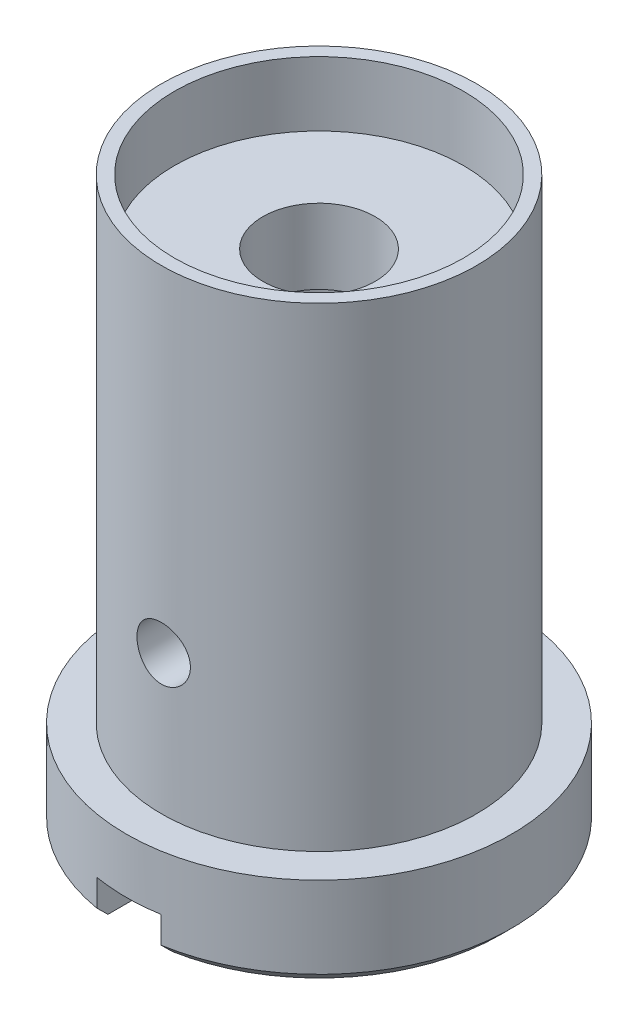
ISO-10303-21;
HEADER;
FILE_DESCRIPTION(('STEP AP214'),'2;1');
FILE_NAME('part.step','',(''),(''),'','','');
FILE_SCHEMA(('AUTOMOTIVE_DESIGN { 1 0 10303 214 1 1 1 1 }'));
ENDSEC;
DATA;
#1=APPLICATION_CONTEXT('core data for automotive mechanical design processes');
#2=APPLICATION_PROTOCOL_DEFINITION('international standard','automotive_design',2000,#1);
#3=PRODUCT_CONTEXT('',#1,'mechanical');
#4=PRODUCT('Part','Part','',(#3));
#5=PRODUCT_RELATED_PRODUCT_CATEGORY('part','',(#4));
#6=PRODUCT_DEFINITION_FORMATION('','',#4);
#7=PRODUCT_DEFINITION_CONTEXT('part definition',#1,'design');
#8=PRODUCT_DEFINITION('design','',#6,#7);
#9=PRODUCT_DEFINITION_SHAPE('','',#8);
#10=(LENGTH_UNIT() NAMED_UNIT(*) SI_UNIT(.MILLI.,.METRE.));
#11=(NAMED_UNIT(*) PLANE_ANGLE_UNIT() SI_UNIT($,.RADIAN.));
#12=(NAMED_UNIT(*) SI_UNIT($,.STERADIAN.) SOLID_ANGLE_UNIT());
#13=UNCERTAINTY_MEASURE_WITH_UNIT(LENGTH_MEASURE(1.E-05),#10,'distance_accuracy_value','');
#14=(GEOMETRIC_REPRESENTATION_CONTEXT(3) GLOBAL_UNCERTAINTY_ASSIGNED_CONTEXT((#13)) GLOBAL_UNIT_ASSIGNED_CONTEXT((#10,
#11,#12)) REPRESENTATION_CONTEXT('',''));
#15=CARTESIAN_POINT('',(0.,0.,0.));
#16=DIRECTION('',(0.,0.,1.));
#17=DIRECTION('',(1.,0.,0.));
#18=AXIS2_PLACEMENT_3D('',#15,#16,#17);
#19=CARTESIAN_POINT('',(4.1656,31.75,0.));
#20=DIRECTION('',(0.,-1.,0.));
#21=DIRECTION('',(0.,0.,-1.));
#22=AXIS2_PLACEMENT_3D('',#19,#20,#21);
#23=PLANE('',#22);
#24=CARTESIAN_POINT('',(0.,31.75,0.));
#25=DIRECTION('',(0.,-1.,0.));
#26=DIRECTION('',(0.,0.,-1.));
#27=AXIS2_PLACEMENT_3D('',#24,#25,#26);
#28=CIRCLE('',#27,4.1656);
#29=CARTESIAN_POINT('',(0.,31.75,-4.1656));
#30=VERTEX_POINT('',#29);
#31=EDGE_CURVE('E20',#30,#30,#28,.F.);
#32=ORIENTED_EDGE('',*,*,#31,.T.);
#33=EDGE_LOOP('',(#32));
#34=FACE_BOUND('',#33,.T.);
#35=CARTESIAN_POINT('',(0.,31.75,0.));
#36=DIRECTION('',(0.,-1.,0.));
#37=DIRECTION('',(0.,0.,-1.));
#38=AXIS2_PLACEMENT_3D('',#35,#36,#37);
#39=CIRCLE('',#38,4.5593);
#40=CARTESIAN_POINT('',(0.,31.75,-4.5593));
#41=VERTEX_POINT('',#40);
#42=EDGE_CURVE('E262',#41,#41,#39,.T.);
#43=ORIENTED_EDGE('',*,*,#42,.T.);
#44=EDGE_LOOP('',(#43));
#45=FACE_BOUND('',#44,.T.);
#46=ADVANCED_FACE('F17',(#34,#45),#23,.T.);
#47=CARTESIAN_POINT('',(0.,0.,0.));
#48=DIRECTION('',(0.,-1.,0.));
#49=DIRECTION('',(0.,0.,-1.));
#50=AXIS2_PLACEMENT_3D('',#47,#48,#49);
#51=CYLINDRICAL_SURFACE('',#50,4.1656);
#52=ORIENTED_EDGE('',*,*,#31,.F.);
#53=EDGE_LOOP('',(#52));
#54=FACE_BOUND('',#53,.T.);
#55=CARTESIAN_POINT('',(0.,37.2872,0.));
#56=DIRECTION('',(0.,-1.,0.));
#57=DIRECTION('',(0.,0.,-1.));
#58=AXIS2_PLACEMENT_3D('',#55,#56,#57);
#59=CIRCLE('',#58,4.1656);
#60=CARTESIAN_POINT('',(0.,37.2872,-4.1656));
#61=VERTEX_POINT('',#60);
#62=EDGE_CURVE('E260',#61,#61,#59,.T.);
#63=ORIENTED_EDGE('',*,*,#62,.F.);
#64=EDGE_LOOP('',(#63));
#65=FACE_BOUND('',#64,.T.);
#66=ADVANCED_FACE('F270',(#54,#65),#51,.F.);
#67=CARTESIAN_POINT('',(0.,0.,0.));
#68=DIRECTION('',(0.,-1.,0.));
#69=DIRECTION('',(0.,0.,-1.));
#70=AXIS2_PLACEMENT_3D('',#67,#68,#69);
#71=CYLINDRICAL_SURFACE('',#70,4.5593);
#72=CARTESIAN_POINT('',(0.,22.225,0.));
#73=DIRECTION('',(0.,-1.,0.));
#74=DIRECTION('',(0.,0.,-1.));
#75=AXIS2_PLACEMENT_3D('',#72,#73,#74);
#76=CIRCLE('',#75,4.5593);
#77=CARTESIAN_POINT('',(0.,22.225,-4.5593));
#78=VERTEX_POINT('',#77);
#79=EDGE_CURVE('E135',#78,#78,#76,.F.);
#80=ORIENTED_EDGE('',*,*,#79,.F.);
#81=EDGE_LOOP('',(#80));
#82=FACE_BOUND('',#81,.T.);
#83=ORIENTED_EDGE('',*,*,#42,.F.);
#84=EDGE_LOOP('',(#83));
#85=FACE_BOUND('',#84,.T.);
#86=ADVANCED_FACE('F273',(#82,#85),#71,.F.);
#87=CARTESIAN_POINT('',(10.7188,37.2872,0.));
#88=DIRECTION('',(0.,1.,0.));
#89=DIRECTION('',(0.,0.,1.));
#90=AXIS2_PLACEMENT_3D('',#87,#88,#89);
#91=PLANE('',#90);
#92=CARTESIAN_POINT('',(0.,37.2872,0.));
#93=DIRECTION('',(0.,-1.,0.));
#94=DIRECTION('',(0.,0.,-1.));
#95=AXIS2_PLACEMENT_3D('',#92,#93,#94);
#96=CIRCLE('',#95,10.7188);
#97=CARTESIAN_POINT('',(0.,37.2872,-10.7188));
#98=VERTEX_POINT('',#97);
#99=EDGE_CURVE('E146',#98,#98,#96,.F.);
#100=ORIENTED_EDGE('',*,*,#99,.T.);
#101=EDGE_LOOP('',(#100));
#102=FACE_BOUND('',#101,.T.);
#103=ORIENTED_EDGE('',*,*,#62,.T.);
#104=EDGE_LOOP('',(#103));
#105=FACE_BOUND('',#104,.T.);
#106=ADVANCED_FACE('F276',(#102,#105),#91,.T.);
#107=CARTESIAN_POINT('',(7.5946,0.,0.));
#108=DIRECTION('',(0.,-1.,0.));
#109=DIRECTION('',(0.,0.,-1.));
#110=AXIS2_PLACEMENT_3D('',#107,#108,#109);
#111=PLANE('',#110);
#112=DIRECTION('',(0.,0.,1.));
#113=VECTOR('',#112,1.);
#114=CARTESIAN_POINT('',(-2.3876,0.,-14.2875));
#115=LINE('',#114,#113);
#116=CARTESIAN_POINT('',(-2.3876,0.,-13.2614820563163));
#117=VERTEX_POINT('',#116);
#118=CARTESIAN_POINT('',(-2.3876,0.,-7.20952948534091));
#119=VERTEX_POINT('',#118);
#120=EDGE_CURVE('E147',#117,#119,#115,.T.);
#121=ORIENTED_EDGE('',*,*,#120,.T.);
#122=CARTESIAN_POINT('',(0.,0.,0.));
#123=DIRECTION('',(0.,-1.,0.));
#124=DIRECTION('',(0.,0.,-1.));
#125=AXIS2_PLACEMENT_3D('',#122,#123,#124);
#126=CIRCLE('',#125,7.5946);
#127=CARTESIAN_POINT('',(-2.3876,0.,7.20952948534091));
#128=VERTEX_POINT('',#127);
#129=EDGE_CURVE('E138',#119,#128,#126,.F.);
#130=ORIENTED_EDGE('',*,*,#129,.T.);
#131=DIRECTION('',(0.,0.,1.));
#132=VECTOR('',#131,1.);
#133=CARTESIAN_POINT('',(-2.3876,0.,-14.2875));
#134=LINE('',#133,#132);
#135=CARTESIAN_POINT('',(-2.3876,0.,13.2614820563163));
#136=VERTEX_POINT('',#135);
#137=EDGE_CURVE('E139',#128,#136,#134,.T.);
#138=ORIENTED_EDGE('',*,*,#137,.T.);
#139=CARTESIAN_POINT('',(0.,0.,0.));
#140=DIRECTION('',(0.,1.,0.));
#141=DIRECTION('',(-1.,0.,0.));
#142=AXIS2_PLACEMENT_3D('',#139,#140,#141);
#143=CIRCLE('',#142,13.4747);
#144=EDGE_CURVE('E142',#117,#136,#143,.T.);
#145=ORIENTED_EDGE('',*,*,#144,.F.);
#146=EDGE_LOOP('',(#121,#130,#138,#145));
#147=FACE_BOUND('',#146,.T.);
#148=ADVANCED_FACE('F278',(#147),#111,.T.);
#149=CARTESIAN_POINT('',(7.5946,0.,0.));
#150=DIRECTION('',(0.,-1.,0.));
#151=DIRECTION('',(0.,0.,-1.));
#152=AXIS2_PLACEMENT_3D('',#149,#150,#151);
#153=PLANE('',#152);
#154=DIRECTION('',(0.,0.,-1.));
#155=VECTOR('',#154,1.);
#156=CARTESIAN_POINT('',(2.3876,0.,-14.2875));
#157=LINE('',#156,#155);
#158=CARTESIAN_POINT('',(2.3876,0.,13.2614820563163));
#159=VERTEX_POINT('',#158);
#160=CARTESIAN_POINT('',(2.3876,0.,7.20952948534091));
#161=VERTEX_POINT('',#160);
#162=EDGE_CURVE('E99',#159,#161,#157,.T.);
#163=ORIENTED_EDGE('',*,*,#162,.T.);
#164=CARTESIAN_POINT('',(0.,0.,0.));
#165=DIRECTION('',(0.,-1.,0.));
#166=DIRECTION('',(0.,0.,-1.));
#167=AXIS2_PLACEMENT_3D('',#164,#165,#166);
#168=CIRCLE('',#167,7.5946);
#169=CARTESIAN_POINT('',(2.3876,0.,-7.20952948534091));
#170=VERTEX_POINT('',#169);
#171=EDGE_CURVE('E128',#161,#170,#168,.F.);
#172=ORIENTED_EDGE('',*,*,#171,.T.);
#173=DIRECTION('',(0.,0.,-1.));
#174=VECTOR('',#173,1.);
#175=CARTESIAN_POINT('',(2.3876,0.,-14.2875));
#176=LINE('',#175,#174);
#177=CARTESIAN_POINT('',(2.3876,0.,-13.2614820563163));
#178=VERTEX_POINT('',#177);
#179=EDGE_CURVE('E129',#170,#178,#176,.T.);
#180=ORIENTED_EDGE('',*,*,#179,.T.);
#181=CARTESIAN_POINT('',(0.,0.,0.));
#182=DIRECTION('',(0.,1.,0.));
#183=DIRECTION('',(-1.,0.,0.));
#184=AXIS2_PLACEMENT_3D('',#181,#182,#183);
#185=CIRCLE('',#184,13.4747);
#186=EDGE_CURVE('E103',#159,#178,#185,.T.);
#187=ORIENTED_EDGE('',*,*,#186,.F.);
#188=EDGE_LOOP('',(#163,#172,#180,#187));
#189=FACE_BOUND('',#188,.T.);
#190=ADVANCED_FACE('F285',(#189),#153,.T.);
#191=CARTESIAN_POINT('',(4.5593,22.225,0.));
#192=DIRECTION('',(0.,-1.,0.));
#193=DIRECTION('',(0.,0.,-1.));
#194=AXIS2_PLACEMENT_3D('',#191,#192,#193);
#195=PLANE('',#194);
#196=ORIENTED_EDGE('',*,*,#79,.T.);
#197=EDGE_LOOP('',(#196));
#198=FACE_BOUND('',#197,.T.);
#199=CARTESIAN_POINT('',(0.,22.225,0.));
#200=DIRECTION('',(0.,-1.,0.));
#201=DIRECTION('',(0.,0.,-1.));
#202=AXIS2_PLACEMENT_3D('',#199,#200,#201);
#203=CIRCLE('',#202,7.5946);
#204=CARTESIAN_POINT('',(0.,22.225,-7.5946));
#205=VERTEX_POINT('',#204);
#206=EDGE_CURVE('E119',#205,#205,#203,.T.);
#207=ORIENTED_EDGE('',*,*,#206,.T.);
#208=EDGE_LOOP('',(#207));
#209=FACE_BOUND('',#208,.T.);
#210=ADVANCED_FACE('F293',(#198,#209),#195,.T.);
#211=CARTESIAN_POINT('',(2.3876,0.,-14.2875));
#212=DIRECTION('',(1.,0.,0.));
#213=DIRECTION('',(0.,0.,-1.));
#214=AXIS2_PLACEMENT_3D('',#211,#212,#213);
#215=PLANE('',#214);
#216=ORIENTED_EDGE('',*,*,#162,.F.);
#217=CARTESIAN_POINT('',(2.3876,0.812799999999997,14.086590165473));
#218=CARTESIAN_POINT('',(2.3876,0.677271911538373,13.949132653244));
#219=CARTESIAN_POINT('',(2.3876,0.541774534073085,13.8116448881336));
#220=CARTESIAN_POINT('',(2.3876,0.270841200739572,13.5366088517482));
#221=CARTESIAN_POINT('',(2.3876,0.135405244871527,13.3990605804731));
#222=CARTESIAN_POINT('',(2.3876,0.,13.2614820563163));
#223=B_SPLINE_CURVE_WITH_KNOTS('',3,(#217,#218,#219,#220,#221,#222),.UNSPECIFIED.,.F.,.F.,(4,2,
4),(0.,0.579104328852117,1.15820865939542),.UNSPECIFIED.);
#224=CARTESIAN_POINT('',(2.3876,0.812799999999997,14.086590165473));
#225=VERTEX_POINT('',#224);
#226=EDGE_CURVE('E93',#225,#159,#223,.T.);
#227=ORIENTED_EDGE('',*,*,#226,.F.);
#228=DIRECTION('',(0.,-1.,0.));
#229=VECTOR('',#228,1.);
#230=CARTESIAN_POINT('',(2.3876,0.,14.086590165473));
#231=LINE('',#230,#229);
#232=CARTESIAN_POINT('',(2.3876,2.794,14.086590165473));
#233=VERTEX_POINT('',#232);
#234=EDGE_CURVE('E97',#233,#225,#231,.T.);
#235=ORIENTED_EDGE('',*,*,#234,.F.);
#236=DIRECTION('',(0.,0.,1.));
#237=VECTOR('',#236,1.);
#238=CARTESIAN_POINT('',(2.3876,2.794,-14.2875));
#239=LINE('',#238,#237);
#240=CARTESIAN_POINT('',(2.3876,2.794,7.20952948534091));
#241=VERTEX_POINT('',#240);
#242=EDGE_CURVE('E471',#233,#241,#239,.F.);
#243=ORIENTED_EDGE('',*,*,#242,.T.);
#244=DIRECTION('',(0.,-1.,0.));
#245=VECTOR('',#244,1.);
#246=CARTESIAN_POINT('',(2.3876,0.,7.20952948534091));
#247=LINE('',#246,#245);
#248=EDGE_CURVE('E131',#241,#161,#247,.T.);
#249=ORIENTED_EDGE('',*,*,#248,.T.);
#250=EDGE_LOOP('',(#216,#227,#235,#243,#249));
#251=FACE_BOUND('',#250,.T.);
#252=ADVANCED_FACE('F95',(#251),#215,.F.);
#253=CARTESIAN_POINT('',(0.,0.812799999999996,0.));
#254=DIRECTION('',(0.,1.,0.));
#255=DIRECTION('',(-1.,0.,0.));
#256=AXIS2_PLACEMENT_3D('',#253,#254,#255);
#257=CONICAL_SURFACE('',#256,14.2875,0.785398163397448);
#258=ORIENTED_EDGE('',*,*,#226,.T.);
#259=ORIENTED_EDGE('',*,*,#186,.T.);
#260=CARTESIAN_POINT('',(2.3876,0.,-13.2614820563163));
#261=CARTESIAN_POINT('',(2.3876,0.135405244871526,-13.3990605804731));
#262=CARTESIAN_POINT('',(2.3876,0.270841200739571,-13.5366088517482));
#263=CARTESIAN_POINT('',(2.3876,0.541774534073084,-13.8116448881336));
#264=CARTESIAN_POINT('',(2.3876,0.677271911538372,-13.949132653244));
#265=CARTESIAN_POINT('',(2.3876,0.812799999999997,-14.086590165473));
#266=B_SPLINE_CURVE_WITH_KNOTS('',3,(#260,#261,#262,#263,#264,#265),.UNSPECIFIED.,.F.,.F.,(4,2,
4),(0.,0.579104330543301,1.15820865939542),.UNSPECIFIED.);
#267=CARTESIAN_POINT('',(2.3876,0.812799999999997,-14.086590165473));
#268=VERTEX_POINT('',#267);
#269=EDGE_CURVE('E109',#178,#268,#266,.T.);
#270=ORIENTED_EDGE('',*,*,#269,.T.);
#271=CARTESIAN_POINT('',(0.,0.812799999999997,0.));
#272=DIRECTION('',(0.,-1.,0.));
#273=DIRECTION('',(0.,0.,-1.));
#274=AXIS2_PLACEMENT_3D('',#271,#272,#273);
#275=CIRCLE('',#274,14.2875);
#276=EDGE_CURVE('E106',#225,#268,#275,.F.);
#277=ORIENTED_EDGE('',*,*,#276,.F.);
#278=EDGE_LOOP('',(#258,#259,#270,#277));
#279=FACE_BOUND('',#278,.T.);
#280=ADVANCED_FACE('F107',(#279),#257,.T.);
#281=CARTESIAN_POINT('',(2.3876,0.,-14.2875));
#282=DIRECTION('',(1.,0.,0.));
#283=DIRECTION('',(0.,0.,-1.));
#284=AXIS2_PLACEMENT_3D('',#281,#282,#283);
#285=PLANE('',#284);
#286=DIRECTION('',(0.,0.,1.));
#287=VECTOR('',#286,1.);
#288=CARTESIAN_POINT('',(2.3876,2.794,-14.2875));
#289=LINE('',#288,#287);
#290=CARTESIAN_POINT('',(2.3876,2.794,-7.20952948534091));
#291=VERTEX_POINT('',#290);
#292=CARTESIAN_POINT('',(2.3876,2.794,-14.086590165473));
#293=VERTEX_POINT('',#292);
#294=EDGE_CURVE('E480',#291,#293,#289,.F.);
#295=ORIENTED_EDGE('',*,*,#294,.T.);
#296=DIRECTION('',(0.,-1.,0.));
#297=VECTOR('',#296,1.);
#298=CARTESIAN_POINT('',(2.3876,0.,-14.086590165473));
#299=LINE('',#298,#297);
#300=EDGE_CURVE('E113',#268,#293,#299,.F.);
#301=ORIENTED_EDGE('',*,*,#300,.F.);
#302=ORIENTED_EDGE('',*,*,#269,.F.);
#303=ORIENTED_EDGE('',*,*,#179,.F.);
#304=DIRECTION('',(0.,-1.,0.));
#305=VECTOR('',#304,1.);
#306=CARTESIAN_POINT('',(2.3876,0.,-7.20952948534091));
#307=LINE('',#306,#305);
#308=EDGE_CURVE('E126',#170,#291,#307,.F.);
#309=ORIENTED_EDGE('',*,*,#308,.T.);
#310=EDGE_LOOP('',(#295,#301,#302,#303,#309));
#311=FACE_BOUND('',#310,.T.);
#312=ADVANCED_FACE('F243',(#311),#285,.F.);
#313=CARTESIAN_POINT('',(-2.3876,2.794,-14.2875));
#314=DIRECTION('',(0.,1.,0.));
#315=DIRECTION('',(0.,0.,1.));
#316=AXIS2_PLACEMENT_3D('',#313,#314,#315);
#317=PLANE('',#316);
#318=CARTESIAN_POINT('',(0.,2.794,0.));
#319=DIRECTION('',(0.,-1.,0.));
#320=DIRECTION('',(0.,0.,-1.));
#321=AXIS2_PLACEMENT_3D('',#318,#319,#320);
#322=CIRCLE('',#321,7.5946);
#323=CARTESIAN_POINT('',(-2.3876,2.794,-7.20952948534091));
#324=VERTEX_POINT('',#323);
#325=EDGE_CURVE('E122',#291,#324,#322,.F.);
#326=ORIENTED_EDGE('',*,*,#325,.T.);
#327=DIRECTION('',(0.,0.,1.));
#328=VECTOR('',#327,1.);
#329=CARTESIAN_POINT('',(-2.3876,2.794,-14.2875));
#330=LINE('',#329,#328);
#331=CARTESIAN_POINT('',(-2.3876,2.794,-14.086590165473));
#332=VERTEX_POINT('',#331);
#333=EDGE_CURVE('E149',#324,#332,#330,.F.);
#334=ORIENTED_EDGE('',*,*,#333,.T.);
#335=CARTESIAN_POINT('',(0.,2.794,0.));
#336=DIRECTION('',(0.,-1.,0.));
#337=DIRECTION('',(0.,0.,-1.));
#338=AXIS2_PLACEMENT_3D('',#335,#336,#337);
#339=CIRCLE('',#338,14.2875);
#340=EDGE_CURVE('E456',#293,#332,#339,.F.);
#341=ORIENTED_EDGE('',*,*,#340,.F.);
#342=ORIENTED_EDGE('',*,*,#294,.F.);
#343=EDGE_LOOP('',(#326,#334,#341,#342));
#344=FACE_BOUND('',#343,.T.);
#345=ADVANCED_FACE('F240',(#344),#317,.F.);
#346=CARTESIAN_POINT('',(-2.3876,0.,-14.2875));
#347=DIRECTION('',(-1.,0.,0.));
#348=DIRECTION('',(0.,0.,1.));
#349=AXIS2_PLACEMENT_3D('',#346,#347,#348);
#350=PLANE('',#349);
#351=ORIENTED_EDGE('',*,*,#120,.F.);
#352=CARTESIAN_POINT('',(-2.3876,0.812799999999998,-14.086590165473));
#353=CARTESIAN_POINT('',(-2.3876,0.677271911538373,-13.949132653244));
#354=CARTESIAN_POINT('',(-2.3876,0.541774534073084,-13.8116448881336));
#355=CARTESIAN_POINT('',(-2.3876,0.270841200739571,-13.5366088517482));
#356=CARTESIAN_POINT('',(-2.3876,0.135405244871526,-13.3990605804731));
#357=CARTESIAN_POINT('',(-2.3876,0.,-13.2614820563163));
#358=B_SPLINE_CURVE_WITH_KNOTS('',3,(#352,#353,#354,#355,#356,#357),.UNSPECIFIED.,.F.,.F.,(4,2,
4),(0.,0.57910432885212,1.15820865939542),.UNSPECIFIED.);
#359=CARTESIAN_POINT('',(-2.3876,0.812799999999998,-14.086590165473));
#360=VERTEX_POINT('',#359);
#361=EDGE_CURVE('E148',#360,#117,#358,.T.);
#362=ORIENTED_EDGE('',*,*,#361,.F.);
#363=DIRECTION('',(0.,-1.,0.));
#364=VECTOR('',#363,1.);
#365=CARTESIAN_POINT('',(-2.38760000000001,0.,-14.086590165473));
#366=LINE('',#365,#364);
#367=EDGE_CURVE('E458',#332,#360,#366,.T.);
#368=ORIENTED_EDGE('',*,*,#367,.F.);
#369=ORIENTED_EDGE('',*,*,#333,.F.);
#370=DIRECTION('',(0.,-1.,0.));
#371=VECTOR('',#370,1.);
#372=CARTESIAN_POINT('',(-2.3876,0.,-7.20952948534091));
#373=LINE('',#372,#371);
#374=EDGE_CURVE('E143',#324,#119,#373,.T.);
#375=ORIENTED_EDGE('',*,*,#374,.T.);
#376=EDGE_LOOP('',(#351,#362,#368,#369,#375));
#377=FACE_BOUND('',#376,.T.);
#378=ADVANCED_FACE('F236',(#377),#350,.F.);
#379=CARTESIAN_POINT('',(0.,0.812799999999996,0.));
#380=DIRECTION('',(0.,1.,0.));
#381=DIRECTION('',(-1.,0.,0.));
#382=AXIS2_PLACEMENT_3D('',#379,#380,#381);
#383=CONICAL_SURFACE('',#382,14.2875,0.785398163397448);
#384=ORIENTED_EDGE('',*,*,#361,.T.);
#385=ORIENTED_EDGE('',*,*,#144,.T.);
#386=CARTESIAN_POINT('',(-2.3876,0.,13.2614820563163));
#387=CARTESIAN_POINT('',(-2.3876,0.135405244871529,13.3990605804731));
#388=CARTESIAN_POINT('',(-2.3876,0.270841200739574,13.5366088517482));
#389=CARTESIAN_POINT('',(-2.3876,0.541774534073086,13.8116448881336));
#390=CARTESIAN_POINT('',(-2.3876,0.677271911538373,13.949132653244));
#391=CARTESIAN_POINT('',(-2.3876,0.812799999999997,14.086590165473));
#392=B_SPLINE_CURVE_WITH_KNOTS('',3,(#386,#387,#388,#389,#390,#391),.UNSPECIFIED.,.F.,.F.,(4,2,
4),(0.,0.579104330543299,1.15820865939541),.UNSPECIFIED.);
#393=CARTESIAN_POINT('',(-2.3876,0.812799999999997,14.086590165473));
#394=VERTEX_POINT('',#393);
#395=EDGE_CURVE('E141',#136,#394,#392,.T.);
#396=ORIENTED_EDGE('',*,*,#395,.T.);
#397=CARTESIAN_POINT('',(0.,0.812799999999997,0.));
#398=DIRECTION('',(0.,-1.,0.));
#399=DIRECTION('',(0.,0.,-1.));
#400=AXIS2_PLACEMENT_3D('',#397,#398,#399);
#401=CIRCLE('',#400,14.2875);
#402=EDGE_CURVE('E453',#360,#394,#401,.F.);
#403=ORIENTED_EDGE('',*,*,#402,.F.);
#404=EDGE_LOOP('',(#384,#385,#396,#403));
#405=FACE_BOUND('',#404,.T.);
#406=ADVANCED_FACE('F213',(#405),#383,.T.);
#407=CARTESIAN_POINT('',(-2.3876,0.,-14.2875));
#408=DIRECTION('',(-1.,0.,0.));
#409=DIRECTION('',(0.,0.,1.));
#410=AXIS2_PLACEMENT_3D('',#407,#408,#409);
#411=PLANE('',#410);
#412=DIRECTION('',(0.,0.,1.));
#413=VECTOR('',#412,1.);
#414=CARTESIAN_POINT('',(-2.3876,2.794,-14.2875));
#415=LINE('',#414,#413);
#416=CARTESIAN_POINT('',(-2.3876,2.794,7.20952948534091));
#417=VERTEX_POINT('',#416);
#418=CARTESIAN_POINT('',(-2.3876,2.794,14.086590165473));
#419=VERTEX_POINT('',#418);
#420=EDGE_CURVE('E35',#417,#419,#415,.T.);
#421=ORIENTED_EDGE('',*,*,#420,.T.);
#422=DIRECTION('',(0.,-1.,0.));
#423=VECTOR('',#422,1.);
#424=CARTESIAN_POINT('',(-2.3876,0.,14.086590165473));
#425=LINE('',#424,#423);
#426=EDGE_CURVE('E452',#394,#419,#425,.F.);
#427=ORIENTED_EDGE('',*,*,#426,.F.);
#428=ORIENTED_EDGE('',*,*,#395,.F.);
#429=ORIENTED_EDGE('',*,*,#137,.F.);
#430=DIRECTION('',(0.,-1.,0.));
#431=VECTOR('',#430,1.);
#432=CARTESIAN_POINT('',(-2.3876,0.,7.20952948534091));
#433=LINE('',#432,#431);
#434=EDGE_CURVE('E136',#128,#417,#433,.F.);
#435=ORIENTED_EDGE('',*,*,#434,.T.);
#436=EDGE_LOOP('',(#421,#427,#428,#429,#435));
#437=FACE_BOUND('',#436,.T.);
#438=ADVANCED_FACE('F208',(#437),#411,.F.);
#439=CARTESIAN_POINT('',(-2.3876,2.794,-14.2875));
#440=DIRECTION('',(0.,1.,0.));
#441=DIRECTION('',(0.,0.,1.));
#442=AXIS2_PLACEMENT_3D('',#439,#440,#441);
#443=PLANE('',#442);
#444=CARTESIAN_POINT('',(0.,2.794,0.));
#445=DIRECTION('',(0.,-1.,0.));
#446=DIRECTION('',(0.,0.,-1.));
#447=AXIS2_PLACEMENT_3D('',#444,#445,#446);
#448=CIRCLE('',#447,7.5946);
#449=EDGE_CURVE('E133',#417,#241,#448,.F.);
#450=ORIENTED_EDGE('',*,*,#449,.T.);
#451=ORIENTED_EDGE('',*,*,#242,.F.);
#452=CARTESIAN_POINT('',(0.,2.794,0.));
#453=DIRECTION('',(0.,-1.,0.));
#454=DIRECTION('',(0.,0.,-1.));
#455=AXIS2_PLACEMENT_3D('',#452,#453,#454);
#456=CIRCLE('',#455,14.2875);
#457=EDGE_CURVE('E117',#419,#233,#456,.F.);
#458=ORIENTED_EDGE('',*,*,#457,.F.);
#459=ORIENTED_EDGE('',*,*,#420,.F.);
#460=EDGE_LOOP('',(#450,#451,#458,#459));
#461=FACE_BOUND('',#460,.T.);
#462=ADVANCED_FACE('F204',(#461),#443,.F.);
#463=CARTESIAN_POINT('',(0.,0.,0.));
#464=DIRECTION('',(0.,-1.,0.));
#465=DIRECTION('',(0.,0.,-1.));
#466=AXIS2_PLACEMENT_3D('',#463,#464,#465);
#467=CYLINDRICAL_SURFACE('',#466,10.7188);
#468=ORIENTED_EDGE('',*,*,#99,.F.);
#469=EDGE_LOOP('',(#468));
#470=FACE_BOUND('',#469,.T.);
#471=CARTESIAN_POINT('',(0.,42.0624,0.));
#472=DIRECTION('',(0.,-1.,0.));
#473=DIRECTION('',(0.,0.,-1.));
#474=AXIS2_PLACEMENT_3D('',#471,#472,#473);
#475=CIRCLE('',#474,10.7188);
#476=CARTESIAN_POINT('',(0.,42.0624,-10.7188));
#477=VERTEX_POINT('',#476);
#478=EDGE_CURVE('E188',#477,#477,#475,.T.);
#479=ORIENTED_EDGE('',*,*,#478,.F.);
#480=EDGE_LOOP('',(#479));
#481=FACE_BOUND('',#480,.T.);
#482=ADVANCED_FACE('F200',(#470,#481),#467,.F.);
#483=CARTESIAN_POINT('',(0.,0.,0.));
#484=DIRECTION('',(0.,-1.,0.));
#485=DIRECTION('',(0.,0.,-1.));
#486=AXIS2_PLACEMENT_3D('',#483,#484,#485);
#487=CYLINDRICAL_SURFACE('',#486,7.5946);
#488=ORIENTED_EDGE('',*,*,#449,.F.);
#489=ORIENTED_EDGE('',*,*,#434,.F.);
#490=ORIENTED_EDGE('',*,*,#129,.F.);
#491=ORIENTED_EDGE('',*,*,#374,.F.);
#492=ORIENTED_EDGE('',*,*,#325,.F.);
#493=ORIENTED_EDGE('',*,*,#308,.F.);
#494=ORIENTED_EDGE('',*,*,#171,.F.);
#495=ORIENTED_EDGE('',*,*,#248,.F.);
#496=EDGE_LOOP('',(#488,#489,#490,#491,#492,#493,#494,#495));
#497=FACE_BOUND('',#496,.T.);
#498=ORIENTED_EDGE('',*,*,#206,.F.);
#499=EDGE_LOOP('',(#498));
#500=FACE_BOUND('',#499,.T.);
#501=CARTESIAN_POINT('',(-1.9812,17.1704,7.33162981334982));
#502=CARTESIAN_POINT('',(-1.98119521072431,17.061209217071,7.33163311535142));
#503=CARTESIAN_POINT('',(-1.97213889495164,16.9519566163936,7.33409691801363));
#504=CARTESIAN_POINT('',(-1.93620470272094,16.736567276342,7.34366336527781));
#505=CARTESIAN_POINT('',(-1.90930944226493,16.6304336818921,7.35077053472541));
#506=CARTESIAN_POINT('',(-1.83863719617433,16.4244776029982,7.36876385555579));
#507=CARTESIAN_POINT('',(-1.7948860301869,16.3246457365379,7.37964422466909));
#508=CARTESIAN_POINT('',(-1.691820548793,16.1337379992916,7.40395053014545));
#509=CARTESIAN_POINT('',(-1.63250704690063,16.0426616711538,7.4173763334369));
#510=CARTESIAN_POINT('',(-1.49848397159982,15.869658469436,7.44562112767283));
#511=CARTESIAN_POINT('',(-1.42346987489287,15.7879713512349,7.46046392480194));
#512=CARTESIAN_POINT('',(-1.26080950382795,15.6381660649204,7.48966787559681));
#513=CARTESIAN_POINT('',(-1.1731593628474,15.5700520654277,7.50402888017013));
#514=CARTESIAN_POINT('',(-0.986042436964098,15.4483294776873,7.5309186139053));
#515=CARTESIAN_POINT('',(-0.886411870296736,15.3949651665993,7.54341507041067));
#516=CARTESIAN_POINT('',(-0.679276300169876,15.3058850578184,7.5648746178666));
#517=CARTESIAN_POINT('',(-0.57178056933693,15.2701488505397,7.57384179252913));
#518=CARTESIAN_POINT('',(-0.386460957627434,15.2257038150976,7.58513989806004));
#519=CARTESIAN_POINT('',(-0.3098619818001,15.2120388289535,7.58866894698713));
#520=CARTESIAN_POINT('',(-0.155519056657319,15.1937854088474,7.59339998742644));
#521=CARTESIAN_POINT('',(-0.0777751506263136,15.1891966326394,7.59460206668408));
#522=CARTESIAN_POINT('',(0.109262013803818,15.1892047306189,7.59459709662967));
#523=CARTESIAN_POINT('',(0.218585691592104,15.1982724645154,7.59221770427256));
#524=CARTESIAN_POINT('',(0.434122885834854,15.2342561389339,7.58295175816065));
#525=CARTESIAN_POINT('',(0.540333313905021,15.2611892154565,7.57606087717865));
#526=CARTESIAN_POINT('',(0.746452206734361,15.3319719528333,7.55853458072446));
#527=CARTESIAN_POINT('',(0.846369409086309,15.3757975294257,7.54790449824765));
#528=CARTESIAN_POINT('',(1.03742177948824,15.4790385411441,7.52402727563521));
#529=CARTESIAN_POINT('',(1.12855750211491,15.5384529909028,7.51078030092551));
#530=CARTESIAN_POINT('',(1.30150086689282,15.6725810829011,7.482772190665));
#531=CARTESIAN_POINT('',(1.38308592256652,15.7475765153094,7.46798610328893));
#532=CARTESIAN_POINT('',(1.53269214779193,15.9101558363616,7.43872496569403));
#533=CARTESIAN_POINT('',(1.6007088356187,15.9977438680438,7.42425001965131));
#534=CARTESIAN_POINT('',(1.72232365581593,16.1847993583505,7.39699328659899));
#535=CARTESIAN_POINT('',(1.77566118795565,16.2844412269387,7.38424392197748));
#536=CARTESIAN_POINT('',(1.86468855061582,16.491600773076,7.36226923774329));
#537=CARTESIAN_POINT('',(1.90039913178158,16.5991090181401,7.35303977738518));
#538=CARTESIAN_POINT('',(1.94477644243474,16.7843618577931,7.34139820893294));
#539=CARTESIAN_POINT('',(1.95841114549109,16.8608757102683,7.33775607654893));
#540=CARTESIAN_POINT('',(1.9766244341169,17.0150493094683,7.33287075542865));
#541=CARTESIAN_POINT('',(1.98120340764645,17.0927090069599,7.33162746392274));
#542=CARTESIAN_POINT('',(1.98119521072431,17.279590782929,7.33163311535142));
#543=CARTESIAN_POINT('',(1.97213889495164,17.3888433836064,7.33409691801363));
#544=CARTESIAN_POINT('',(1.93620470272094,17.604232723658,7.34366336527781));
#545=CARTESIAN_POINT('',(1.90930944226493,17.7103663181079,7.35077053472541));
#546=CARTESIAN_POINT('',(1.83863719617433,17.9163223970018,7.36876385555579));
#547=CARTESIAN_POINT('',(1.7948860301869,18.0161542634621,7.37964422466909));
#548=CARTESIAN_POINT('',(1.691820548793,18.2070620007084,7.40395053014545));
#549=CARTESIAN_POINT('',(1.63250704690063,18.2981383288462,7.4173763334369));
#550=CARTESIAN_POINT('',(1.49848397159982,18.471141530564,7.44562112767283));
#551=CARTESIAN_POINT('',(1.42346987489287,18.5528286487651,7.46046392480194));
#552=CARTESIAN_POINT('',(1.26080950382795,18.7026339350796,7.48966787559681));
#553=CARTESIAN_POINT('',(1.1731593628474,18.7707479345723,7.50402888017013));
#554=CARTESIAN_POINT('',(0.986042436964099,18.8924705223127,7.53091861390531));
#555=CARTESIAN_POINT('',(0.886411870296735,18.9458348334007,7.54341507041067));
#556=CARTESIAN_POINT('',(0.679276300169876,19.0349149421816,7.56487461786659));
#557=CARTESIAN_POINT('',(0.57178056933693,19.0706511494603,7.57384179252913));
#558=CARTESIAN_POINT('',(0.386460957627435,19.1150961849024,7.58513989806004));
#559=CARTESIAN_POINT('',(0.309861981800101,19.1287611710465,7.58866894698713));
#560=CARTESIAN_POINT('',(0.155519056657319,19.1470145911526,7.59339998742644));
#561=CARTESIAN_POINT('',(0.0777751506263143,19.1516033673606,7.59460206668408));
#562=CARTESIAN_POINT('',(-0.109262013803817,19.1515952693811,7.59459709662967));
#563=CARTESIAN_POINT('',(-0.218585691592103,19.1425275354846,7.59221770427256));
#564=CARTESIAN_POINT('',(-0.434122885834853,19.1065438610661,7.58295175816065));
#565=CARTESIAN_POINT('',(-0.54033331390502,19.0796107845435,7.57606087717865));
#566=CARTESIAN_POINT('',(-0.74645220673436,19.0088280471667,7.55853458072446));
#567=CARTESIAN_POINT('',(-0.846369409086307,18.9650024705743,7.54790449824765));
#568=CARTESIAN_POINT('',(-1.03742177948824,18.8617614588559,7.52402727563521));
#569=CARTESIAN_POINT('',(-1.12855750211491,18.8023470090972,7.51078030092551));
#570=CARTESIAN_POINT('',(-1.30150086689281,18.6682189170989,7.482772190665));
#571=CARTESIAN_POINT('',(-1.38308592256652,18.5932234846906,7.46798610328893));
#572=CARTESIAN_POINT('',(-1.53269214779193,18.4306441636384,7.43872496569403));
#573=CARTESIAN_POINT('',(-1.6007088356187,18.3430561319562,7.42425001965131));
#574=CARTESIAN_POINT('',(-1.72232365581592,18.1560006416495,7.39699328659899));
#575=CARTESIAN_POINT('',(-1.77566118795565,18.0563587730613,7.38424392197748));
#576=CARTESIAN_POINT('',(-1.86468855061582,17.849199226924,7.36226923774329));
#577=CARTESIAN_POINT('',(-1.90039913178158,17.7416909818599,7.35303977738518));
#578=CARTESIAN_POINT('',(-1.94477644243474,17.5564381422069,7.34139820893294));
#579=CARTESIAN_POINT('',(-1.95841114549109,17.4799242897317,7.33775607654893));
#580=CARTESIAN_POINT('',(-1.9766244341169,17.3257506905317,7.33287075542865));
#581=CARTESIAN_POINT('',(-1.98120340764645,17.2480909930401,7.33162746392274));
#582=CARTESIAN_POINT('',(-1.9812,17.1704,7.33162981334982));
#583=B_SPLINE_CURVE_WITH_KNOTS('',3,(#501,#502,#503,#504,#505,#506,#507,#508,#509,#510,#511,
#512,#513,#514,#515,#516,#517,#518,#519,#520,#521,#522,#523,#524,#525,#526,#527,#528,#529,#530,
#531,#532,#533,#534,#535,#536,#537,#538,#539,#540,#541,#542,#543,#544,#545,#546,#547,#548,#549,
#550,#551,#552,#553,#554,#555,#556,#557,#558,#559,#560,#561,#562,#563,#564,#565,#566,#567,#568,
#569,#570,#571,#572,#573,#574,#575,#576,#577,#578,#579,#580,#581,#582),.UNSPECIFIED.,.T.,.F.,(4,
2,2,2,2,2,2,2,2,2,2,2,2,2,2,2,2,2,2,2,2,2,2,2,2,2,2,2,2,2,2,2,2,2,2,2,2,2,2,2,4),(0.,
0.327283294732184,0.654885995562378,0.981988861493613,1.30907463167553,1.6432163178033,
1.97746046898888,2.31694728850994,2.65604012670124,2.88916890993537,3.12228890217382,
3.44978630468333,3.77759828981848,4.1049446198074,4.43227026332947,4.76613158277652,
5.10010299697361,5.43966856226674,5.77883342808863,6.01171071761827,6.24457803014349,
6.57186132487567,6.89946402570586,7.22656689163709,7.55365266181901,7.88779434794678,
8.22203849913236,8.56152531865343,8.90061815684472,9.13374694007885,9.3668669323173,
9.69436433482681,10.022176319962,10.3495226499509,10.676848293473,11.01070961292,
11.3446810271171,11.6842465924102,12.0234114582321,12.2562887477617,12.489156060287),.UNSPECIFIED.);
#584=CARTESIAN_POINT('',(-1.9812,17.1704,7.33162981334982));
#585=VERTEX_POINT('',#584);
#586=EDGE_CURVE('E186',#585,#585,#583,.T.);
#587=ORIENTED_EDGE('',*,*,#586,.T.);
#588=EDGE_LOOP('',(#587));
#589=FACE_BOUND('',#588,.T.);
#590=ADVANCED_FACE('F195',(#497,#500,#589),#487,.F.);
#591=CARTESIAN_POINT('',(0.,0.,0.));
#592=DIRECTION('',(0.,-1.,0.));
#593=DIRECTION('',(0.,0.,-1.));
#594=AXIS2_PLACEMENT_3D('',#591,#592,#593);
#595=CYLINDRICAL_SURFACE('',#594,14.2875);
#596=CARTESIAN_POINT('',(0.,6.858,0.));
#597=DIRECTION('',(0.,-1.,0.));
#598=DIRECTION('',(0.,0.,-1.));
#599=AXIS2_PLACEMENT_3D('',#596,#597,#598);
#600=CIRCLE('',#599,14.2875);
#601=CARTESIAN_POINT('',(0.,6.858,-14.2875));
#602=VERTEX_POINT('',#601);
#603=EDGE_CURVE('E179',#602,#602,#600,.F.);
#604=ORIENTED_EDGE('',*,*,#603,.F.);
#605=EDGE_LOOP('',(#604));
#606=FACE_BOUND('',#605,.T.);
#607=ORIENTED_EDGE('',*,*,#426,.T.);
#608=ORIENTED_EDGE('',*,*,#457,.T.);
#609=ORIENTED_EDGE('',*,*,#234,.T.);
#610=ORIENTED_EDGE('',*,*,#276,.T.);
#611=ORIENTED_EDGE('',*,*,#300,.T.);
#612=ORIENTED_EDGE('',*,*,#340,.T.);
#613=ORIENTED_EDGE('',*,*,#367,.T.);
#614=ORIENTED_EDGE('',*,*,#402,.T.);
#615=EDGE_LOOP('',(#607,#608,#609,#610,#611,#612,#613,#614));
#616=FACE_BOUND('',#615,.T.);
#617=ADVANCED_FACE('F116',(#606,#616),#595,.T.);
#618=CARTESIAN_POINT('',(11.684,42.0624,0.));
#619=DIRECTION('',(0.,1.,0.));
#620=DIRECTION('',(0.,0.,1.));
#621=AXIS2_PLACEMENT_3D('',#618,#619,#620);
#622=PLANE('',#621);
#623=CARTESIAN_POINT('',(0.,42.0624,0.));
#624=DIRECTION('',(0.,-1.,0.));
#625=DIRECTION('',(0.,0.,-1.));
#626=AXIS2_PLACEMENT_3D('',#623,#624,#625);
#627=CIRCLE('',#626,11.684);
#628=CARTESIAN_POINT('',(0.,42.0624,-11.684));
#629=VERTEX_POINT('',#628);
#630=EDGE_CURVE('E157',#629,#629,#627,.T.);
#631=ORIENTED_EDGE('',*,*,#630,.F.);
#632=EDGE_LOOP('',(#631));
#633=FACE_BOUND('',#632,.T.);
#634=ORIENTED_EDGE('',*,*,#478,.T.);
#635=EDGE_LOOP('',(#634));
#636=FACE_BOUND('',#635,.T.);
#637=ADVANCED_FACE('F174',(#633,#636),#622,.T.);
#638=CARTESIAN_POINT('',(0.,17.1704,16.764));
#639=DIRECTION('',(0.,0.,-1.));
#640=DIRECTION('',(-1.,0.,0.));
#641=AXIS2_PLACEMENT_3D('',#638,#639,#640);
#642=CYLINDRICAL_SURFACE('',#641,1.9812);
#643=ORIENTED_EDGE('',*,*,#586,.F.);
#644=EDGE_LOOP('',(#643));
#645=FACE_BOUND('',#644,.T.);
#646=CARTESIAN_POINT('',(0.,19.1516,11.684));
#647=CARTESIAN_POINT('',(0.110423292230109,19.1515952203441,11.6839979331365));
#648=CARTESIAN_POINT('',(0.220915307998587,19.1423360792642,11.6824181384414));
#649=CARTESIAN_POINT('',(0.438808777050069,19.1055572049617,11.6762673596921));
#650=CARTESIAN_POINT('',(0.546206881652143,19.0780184084115,11.6716932530247));
#651=CARTESIAN_POINT('',(0.754714903941659,19.0055367643508,11.6600667858392));
#652=CARTESIAN_POINT('',(0.855830181706817,18.9606089952498,11.6530165729033));
#653=CARTESIAN_POINT('',(1.04906833803922,18.8546658411444,11.6372128296948));
#654=CARTESIAN_POINT('',(1.14119274520462,18.793653197389,11.6284595897253));
#655=CARTESIAN_POINT('',(1.31475737342468,18.656636101764,11.6101232801091));
#656=CARTESIAN_POINT('',(1.39609685768529,18.5805049199424,11.6005336087917));
#657=CARTESIAN_POINT('',(1.54493006893701,18.415662169024,11.5816531868232));
#658=CARTESIAN_POINT('',(1.61241989638987,18.3269470686316,11.5723625209799));
#659=CARTESIAN_POINT('',(1.73204888722455,18.138739501316,11.5550660624445));
#660=CARTESIAN_POINT('',(1.78408037083922,18.0391777478296,11.5470694516295));
#661=CARTESIAN_POINT('',(1.87058891366031,17.8326370232162,11.5333728400039));
#662=CARTESIAN_POINT('',(1.90508577069716,17.7256665728469,11.527670250606));
#663=CARTESIAN_POINT('',(1.94719886066994,17.5435040480097,11.5206141495783));
#664=CARTESIAN_POINT('',(1.95993018500935,17.4694854912555,11.5184462845095));
#665=CARTESIAN_POINT('',(1.97693232193825,17.3204552009519,11.5155402922547));
#666=CARTESIAN_POINT('',(1.98120325615402,17.2454434816958,11.5148021445151));
#667=CARTESIAN_POINT('',(1.98119520926565,17.0599895638966,11.5148058072612));
#668=CARTESIAN_POINT('',(1.97193815143587,16.9495103721811,11.5164090520487));
#669=CARTESIAN_POINT('',(1.93516830539018,16.7316435595865,11.5226435132313));
#670=CARTESIAN_POINT('',(1.90763640989389,16.6242592973606,11.5272778987651));
#671=CARTESIAN_POINT('',(1.8351749444561,16.415780562696,11.5390349227712));
#672=CARTESIAN_POINT('',(1.79026077679499,16.3146806135722,11.5461553578316));
#673=CARTESIAN_POINT('',(1.68434967272017,16.1214682416285,11.5620792400729));
#674=CARTESIAN_POINT('',(1.62335544500094,16.0293543086864,11.5708824037287));
#675=CARTESIAN_POINT('',(1.48635712830744,15.8557782753498,11.5892797690501));
#676=CARTESIAN_POINT('',(1.41022218136211,15.7744201310754,11.5988804092585));
#677=CARTESIAN_POINT('',(1.24536401232562,15.6255507803641,11.6177361823268));
#678=CARTESIAN_POINT('',(1.15663730856823,15.5580434163868,11.6269912187291));
#679=CARTESIAN_POINT('',(0.96841918932085,15.438395773837,11.6441832074982));
#680=CARTESIAN_POINT('',(0.868860485887748,15.3863600379428,11.6521110414778));
#681=CARTESIAN_POINT('',(0.662326345677575,15.2998427619851,11.6656695345154));
#682=CARTESIAN_POINT('',(0.555359401688339,15.2653414869167,11.6713027747103));
#683=CARTESIAN_POINT('',(0.37318513980482,15.2232159999873,11.6782689545537));
#684=CARTESIAN_POINT('',(0.299150313373458,15.2104790743609,11.6804076004228));
#685=CARTESIAN_POINT('',(0.150087566882124,15.1934695076974,11.6832738159795));
#686=CARTESIAN_POINT('',(0.0750596604000862,15.1891967510537,11.6840014049398));
#687=CARTESIAN_POINT('',(-0.110423292230106,15.1892047796559,11.6839979331365));
#688=CARTESIAN_POINT('',(-0.220915307998584,15.1984639207358,11.6824181384414));
#689=CARTESIAN_POINT('',(-0.438808777050066,15.2352427950383,11.6762673596921));
#690=CARTESIAN_POINT('',(-0.546206881652139,15.2627815915885,11.6716932530247));
#691=CARTESIAN_POINT('',(-0.754714903941656,15.3352632356492,11.6600667858392));
#692=CARTESIAN_POINT('',(-0.855830181706814,15.3801910047502,11.6530165729033));
#693=CARTESIAN_POINT('',(-1.04906833803921,15.4861341588556,11.6372128296948));
#694=CARTESIAN_POINT('',(-1.14119274520461,15.547146802611,11.6284595897253));
#695=CARTESIAN_POINT('',(-1.31475737342468,15.684163898236,11.6101232801091));
#696=CARTESIAN_POINT('',(-1.39609685768529,15.7602950800576,11.6005336087917));
#697=CARTESIAN_POINT('',(-1.54493006893701,15.925137830976,11.5816531868232));
#698=CARTESIAN_POINT('',(-1.61241989638987,16.0138529313684,11.5723625209799));
#699=CARTESIAN_POINT('',(-1.73204888722455,16.2020604986839,11.5550660624445));
#700=CARTESIAN_POINT('',(-1.78408037083922,16.3016222521704,11.5470694516295));
#701=CARTESIAN_POINT('',(-1.87058891366031,16.5081629767838,11.5333728400039));
#702=CARTESIAN_POINT('',(-1.90508577069716,16.6151334271531,11.527670250606));
#703=CARTESIAN_POINT('',(-1.94719886066994,16.7972959519903,11.5206141495783));
#704=CARTESIAN_POINT('',(-1.95993018500935,16.8713145087445,11.5184462845095));
#705=CARTESIAN_POINT('',(-1.97693232193825,17.0203447990481,11.5155402922547));
#706=CARTESIAN_POINT('',(-1.98120325615402,17.0953565183042,11.5148021445151));
#707=CARTESIAN_POINT('',(-1.98119520926565,17.2808104361034,11.5148058072612));
#708=CARTESIAN_POINT('',(-1.97193815143587,17.3912896278189,11.5164090520487));
#709=CARTESIAN_POINT('',(-1.93516830539018,17.6091564404135,11.5226435132313));
#710=CARTESIAN_POINT('',(-1.90763640989389,17.7165407026394,11.5272778987651));
#711=CARTESIAN_POINT('',(-1.8351749444561,17.925019437304,11.5390349227712));
#712=CARTESIAN_POINT('',(-1.79026077679499,18.0261193864278,11.5461553578316));
#713=CARTESIAN_POINT('',(-1.68434967272017,18.2193317583715,11.5620792400729));
#714=CARTESIAN_POINT('',(-1.62335544500094,18.3114456913136,11.5708824037287));
#715=CARTESIAN_POINT('',(-1.48635712830744,18.4850217246502,11.5892797690501));
#716=CARTESIAN_POINT('',(-1.41022218136211,18.5663798689246,11.5988804092585));
#717=CARTESIAN_POINT('',(-1.24536401232562,18.7152492196359,11.6177361823268));
#718=CARTESIAN_POINT('',(-1.15663730856823,18.7827565836132,11.6269912187291));
#719=CARTESIAN_POINT('',(-0.968419189320852,18.902404226163,11.6441832074982));
#720=CARTESIAN_POINT('',(-0.868860485887749,18.9544399620572,11.6521110414778));
#721=CARTESIAN_POINT('',(-0.662326345677576,19.0409572380149,11.6656695345154));
#722=CARTESIAN_POINT('',(-0.55535940168834,19.0754585130833,11.6713027747103));
#723=CARTESIAN_POINT('',(-0.37318513980482,19.1175840000127,11.6782689545537));
#724=CARTESIAN_POINT('',(-0.299150313373458,19.1303209256391,11.6804076004228));
#725=CARTESIAN_POINT('',(-0.150087566882121,19.1473304923026,11.6832738159795));
#726=CARTESIAN_POINT('',(-0.0750596604000835,19.1516032489463,11.6840014049398));
#727=CARTESIAN_POINT('',(0.,19.1516,11.684));
#728=B_SPLINE_CURVE_WITH_KNOTS('',3,(#646,#647,#648,#649,#650,#651,#652,#653,#654,#655,#656,
#657,#658,#659,#660,#661,#662,#663,#664,#665,#666,#667,#668,#669,#670,#671,#672,#673,#674,#675,
#676,#677,#678,#679,#680,#681,#682,#683,#684,#685,#686,#687,#688,#689,#690,#691,#692,#693,#694,
#695,#696,#697,#698,#699,#700,#701,#702,#703,#704,#705,#706,#707,#708,#709,#710,#711,#712,#713,
#714,#715,#716,#717,#718,#719,#720,#721,#722,#723,#724,#725,#726,#727),.UNSPECIFIED.,.T.,.F.,(4,
2,2,2,2,2,2,2,2,2,2,2,2,2,2,2,2,2,2,2,2,2,2,2,2,2,2,2,2,2,2,2,2,2,2,2,2,2,2,2,4),(0.,
0.330994418816769,0.662334565669659,0.993388040637868,1.32438513257504,1.65828374839144,
1.99227624879551,2.32854348097271,2.66443019563656,2.88937660826341,3.11431978704477,
3.44527557303061,3.77657793647909,4.10758740544734,4.43854115128618,4.7724903690134,
5.10653210546733,5.44278220099755,5.77865300484813,6.00364781806828,6.22863955820711,
6.55963397702388,6.89097412387677,7.22202759884498,7.55302469078215,7.88692330659854,
8.22091580700261,8.55718303917981,8.89306975384367,9.11801616647051,9.34295934525188,
9.67391513123772,10.0052174946862,10.3362269636544,10.6671807094933,11.0011299272205,
11.3351716636744,11.6714217592047,12.0072925630552,12.2322873762754,12.4572791164142),.UNSPECIFIED.);
#729=CARTESIAN_POINT('',(0.,19.1516,11.684));
#730=VERTEX_POINT('',#729);
#731=EDGE_CURVE('E26',#730,#730,#728,.T.);
#732=ORIENTED_EDGE('',*,*,#731,.F.);
#733=EDGE_LOOP('',(#732));
#734=FACE_BOUND('',#733,.T.);
#735=ADVANCED_FACE('F159',(#645,#734),#642,.F.);
#736=CARTESIAN_POINT('',(14.2875,6.858,0.));
#737=DIRECTION('',(0.,1.,0.));
#738=DIRECTION('',(0.,0.,1.));
#739=AXIS2_PLACEMENT_3D('',#736,#737,#738);
#740=PLANE('',#739);
#741=ORIENTED_EDGE('',*,*,#603,.T.);
#742=EDGE_LOOP('',(#741));
#743=FACE_BOUND('',#742,.T.);
#744=CARTESIAN_POINT('',(0.,6.858,0.));
#745=DIRECTION('',(0.,-1.,0.));
#746=DIRECTION('',(0.,0.,-1.));
#747=AXIS2_PLACEMENT_3D('',#744,#745,#746);
#748=CIRCLE('',#747,11.684);
#749=CARTESIAN_POINT('',(0.,6.858,-11.684));
#750=VERTEX_POINT('',#749);
#751=EDGE_CURVE('E11',#750,#750,#748,.F.);
#752=ORIENTED_EDGE('',*,*,#751,.F.);
#753=EDGE_LOOP('',(#752));
#754=FACE_BOUND('',#753,.T.);
#755=ADVANCED_FACE('F166',(#743,#754),#740,.T.);
#756=CARTESIAN_POINT('',(0.,0.,0.));
#757=DIRECTION('',(0.,-1.,0.));
#758=DIRECTION('',(0.,0.,-1.));
#759=AXIS2_PLACEMENT_3D('',#756,#757,#758);
#760=CYLINDRICAL_SURFACE('',#759,11.684);
#761=ORIENTED_EDGE('',*,*,#731,.T.);
#762=EDGE_LOOP('',(#761));
#763=FACE_BOUND('',#762,.T.);
#764=ORIENTED_EDGE('',*,*,#751,.T.);
#765=EDGE_LOOP('',(#764));
#766=FACE_BOUND('',#765,.T.);
#767=ORIENTED_EDGE('',*,*,#630,.T.);
#768=EDGE_LOOP('',(#767));
#769=FACE_BOUND('',#768,.T.);
#770=ADVANCED_FACE('F163',(#763,#766,#769),#760,.T.);
#771=CLOSED_SHELL('',(#46,#66,#86,#106,#148,#190,#210,#252,#280,#312,#345,#378,#406,#438,#462,
#482,#590,#617,#637,#735,#755,#770));
#772=MANIFOLD_SOLID_BREP('B1',#771);
#773=ADVANCED_BREP_SHAPE_REPRESENTATION('',(#18,#772),#14);
#774=SHAPE_DEFINITION_REPRESENTATION(#9,#773);
ENDSEC;
END-ISO-10303-21;
